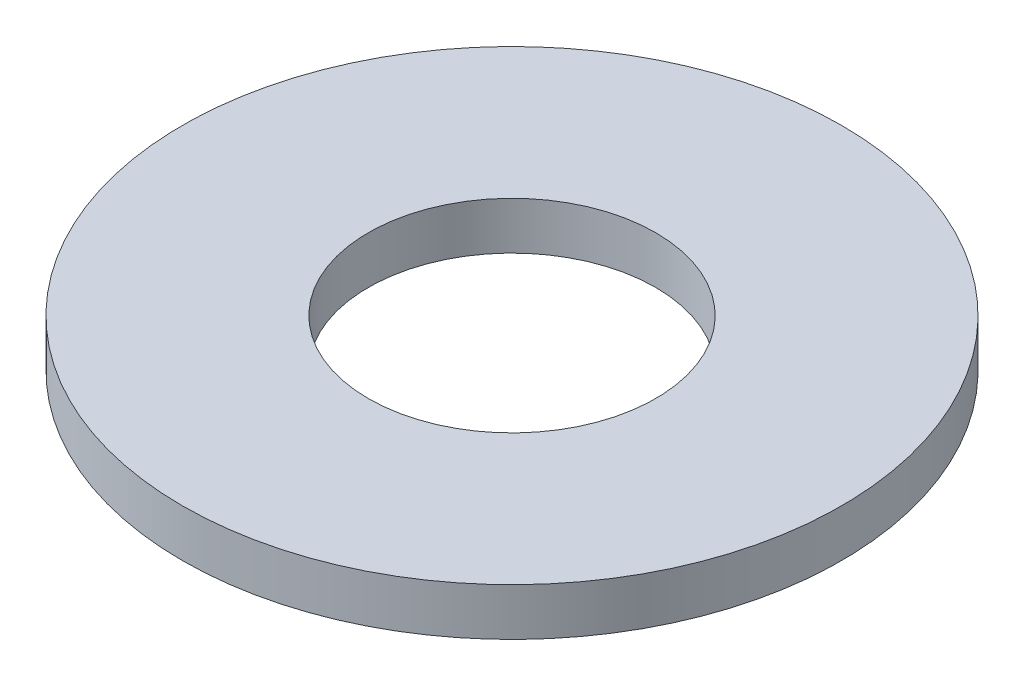
ISO-10303-21;
HEADER;
FILE_DESCRIPTION(('STEP AP214'),'2;1');
FILE_NAME('part.step','',(''),(''),'','','');
FILE_SCHEMA(('AUTOMOTIVE_DESIGN { 1 0 10303 214 1 1 1 1 }'));
ENDSEC;
DATA;
#1=APPLICATION_CONTEXT('core data for automotive mechanical design processes');
#2=APPLICATION_PROTOCOL_DEFINITION('international standard','automotive_design',2000,#1);
#3=PRODUCT_CONTEXT('',#1,'mechanical');
#4=PRODUCT('Part','Part','',(#3));
#5=PRODUCT_RELATED_PRODUCT_CATEGORY('part','',(#4));
#6=PRODUCT_DEFINITION_FORMATION('','',#4);
#7=PRODUCT_DEFINITION_CONTEXT('part definition',#1,'design');
#8=PRODUCT_DEFINITION('design','',#6,#7);
#9=PRODUCT_DEFINITION_SHAPE('','',#8);
#10=(LENGTH_UNIT() NAMED_UNIT(*) SI_UNIT(.MILLI.,.METRE.));
#11=(NAMED_UNIT(*) PLANE_ANGLE_UNIT() SI_UNIT($,.RADIAN.));
#12=(NAMED_UNIT(*) SI_UNIT($,.STERADIAN.) SOLID_ANGLE_UNIT());
#13=UNCERTAINTY_MEASURE_WITH_UNIT(LENGTH_MEASURE(1.E-05),#10,'distance_accuracy_value','');
#14=(GEOMETRIC_REPRESENTATION_CONTEXT(3) GLOBAL_UNCERTAINTY_ASSIGNED_CONTEXT((#13)) GLOBAL_UNIT_ASSIGNED_CONTEXT((#10,
#11,#12)) REPRESENTATION_CONTEXT('',''));
#15=CARTESIAN_POINT('',(0.,0.,0.));
#16=DIRECTION('',(0.,0.,1.));
#17=DIRECTION('',(1.,0.,0.));
#18=AXIS2_PLACEMENT_3D('',#15,#16,#17);
#19=CARTESIAN_POINT('',(0.,0.4572,0.));
#20=DIRECTION('',(0.,-1.,0.));
#21=DIRECTION('',(0.,0.,-1.));
#22=AXIS2_PLACEMENT_3D('',#19,#20,#21);
#23=CYLINDRICAL_SURFACE('',#22,3.175);
#24=CARTESIAN_POINT('',(0.,0.4572,0.));
#25=DIRECTION('',(0.,1.,0.));
#26=DIRECTION('',(0.,0.,1.));
#27=AXIS2_PLACEMENT_3D('',#24,#25,#26);
#28=CIRCLE('',#27,3.175);
#29=CARTESIAN_POINT('',(0.,0.4572,3.175));
#30=VERTEX_POINT('',#29);
#31=EDGE_CURVE('E10',#30,#30,#28,.T.);
#32=ORIENTED_EDGE('',*,*,#31,.F.);
#33=EDGE_LOOP('',(#32));
#34=FACE_BOUND('',#33,.T.);
#35=CARTESIAN_POINT('',(0.,0.,0.));
#36=DIRECTION('',(0.,1.,0.));
#37=DIRECTION('',(0.,0.,1.));
#38=AXIS2_PLACEMENT_3D('',#35,#36,#37);
#39=CIRCLE('',#38,3.175);
#40=CARTESIAN_POINT('',(0.,0.,3.175));
#41=VERTEX_POINT('',#40);
#42=EDGE_CURVE('E33',#41,#41,#39,.T.);
#43=ORIENTED_EDGE('',*,*,#42,.T.);
#44=EDGE_LOOP('',(#43));
#45=FACE_BOUND('',#44,.T.);
#46=ADVANCED_FACE('F30',(#34,#45),#23,.T.);
#47=CARTESIAN_POINT('',(0.,0.4572,0.));
#48=DIRECTION('',(0.,1.,0.));
#49=DIRECTION('',(0.,0.,1.));
#50=AXIS2_PLACEMENT_3D('',#47,#48,#49);
#51=PLANE('',#50);
#52=CARTESIAN_POINT('',(0.,0.4572,0.));
#53=DIRECTION('',(0.,1.,0.));
#54=DIRECTION('',(0.,0.,1.));
#55=AXIS2_PLACEMENT_3D('',#52,#53,#54);
#56=CIRCLE('',#55,1.3843);
#57=CARTESIAN_POINT('',(0.,0.4572,1.3843));
#58=VERTEX_POINT('',#57);
#59=EDGE_CURVE('E42',#58,#58,#56,.T.);
#60=ORIENTED_EDGE('',*,*,#59,.F.);
#61=EDGE_LOOP('',(#60));
#62=FACE_BOUND('',#61,.T.);
#63=ORIENTED_EDGE('',*,*,#31,.T.);
#64=EDGE_LOOP('',(#63));
#65=FACE_BOUND('',#64,.T.);
#66=ADVANCED_FACE('F57',(#62,#65),#51,.T.);
#67=CARTESIAN_POINT('',(0.,0.,0.));
#68=DIRECTION('',(0.,1.,0.));
#69=DIRECTION('',(0.,0.,1.));
#70=AXIS2_PLACEMENT_3D('',#67,#68,#69);
#71=PLANE('',#70);
#72=CARTESIAN_POINT('',(0.,0.,0.));
#73=DIRECTION('',(0.,1.,0.));
#74=DIRECTION('',(0.,0.,1.));
#75=AXIS2_PLACEMENT_3D('',#72,#73,#74);
#76=CIRCLE('',#75,1.3843);
#77=CARTESIAN_POINT('',(0.,0.,1.3843));
#78=VERTEX_POINT('',#77);
#79=EDGE_CURVE('E40',#78,#78,#76,.T.);
#80=ORIENTED_EDGE('',*,*,#79,.T.);
#81=EDGE_LOOP('',(#80));
#82=FACE_BOUND('',#81,.T.);
#83=ORIENTED_EDGE('',*,*,#42,.F.);
#84=EDGE_LOOP('',(#83));
#85=FACE_BOUND('',#84,.T.);
#86=ADVANCED_FACE('F48',(#82,#85),#71,.F.);
#87=CARTESIAN_POINT('',(0.,0.,0.));
#88=DIRECTION('',(0.,1.,0.));
#89=DIRECTION('',(0.,0.,1.));
#90=AXIS2_PLACEMENT_3D('',#87,#88,#89);
#91=CYLINDRICAL_SURFACE('',#90,1.3843);
#92=ORIENTED_EDGE('',*,*,#79,.F.);
#93=EDGE_LOOP('',(#92));
#94=FACE_BOUND('',#93,.T.);
#95=ORIENTED_EDGE('',*,*,#59,.T.);
#96=EDGE_LOOP('',(#95));
#97=FACE_BOUND('',#96,.T.);
#98=ADVANCED_FACE('F51',(#94,#97),#91,.F.);
#99=CLOSED_SHELL('',(#46,#66,#86,#98));
#100=MANIFOLD_SOLID_BREP('B2',#99);
#101=ADVANCED_BREP_SHAPE_REPRESENTATION('',(#18,#100),#14);
#102=SHAPE_DEFINITION_REPRESENTATION(#9,#101);
ENDSEC;
END-ISO-10303-21;
